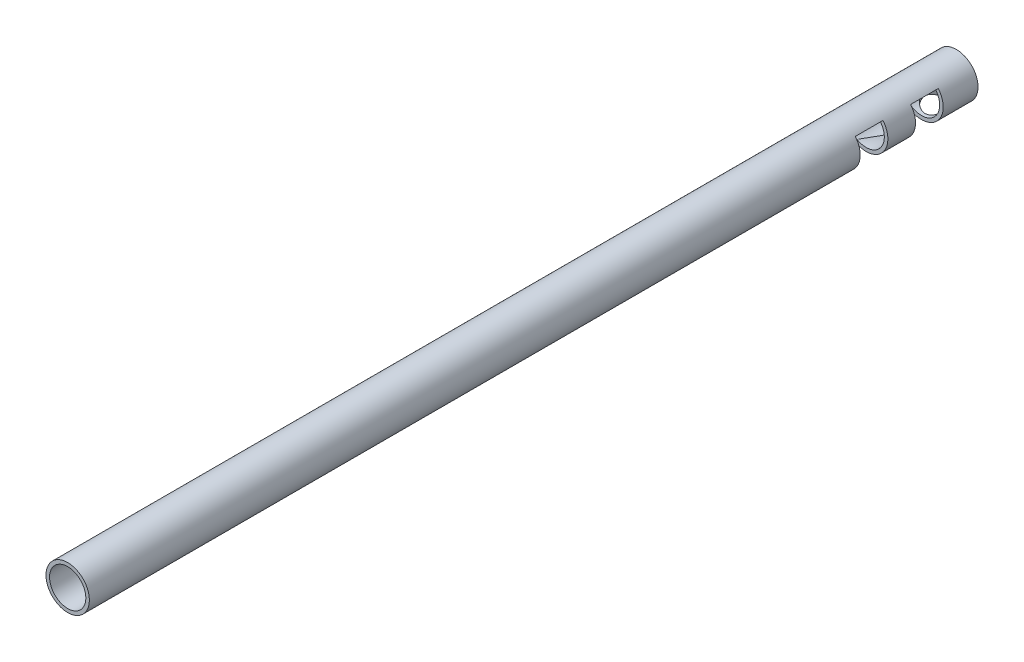
ISO-10303-21;
HEADER;
FILE_DESCRIPTION(('STEP AP214'),'2;1');
FILE_NAME('part.step','',(''),(''),'','','');
FILE_SCHEMA(('AUTOMOTIVE_DESIGN { 1 0 10303 214 1 1 1 1 }'));
ENDSEC;
DATA;
#1=APPLICATION_CONTEXT('core data for automotive mechanical design processes');
#2=APPLICATION_PROTOCOL_DEFINITION('international standard','automotive_design',2000,#1);
#3=PRODUCT_CONTEXT('',#1,'mechanical');
#4=PRODUCT('Part','Part','',(#3));
#5=PRODUCT_RELATED_PRODUCT_CATEGORY('part','',(#4));
#6=PRODUCT_DEFINITION_FORMATION('','',#4);
#7=PRODUCT_DEFINITION_CONTEXT('part definition',#1,'design');
#8=PRODUCT_DEFINITION('design','',#6,#7);
#9=PRODUCT_DEFINITION_SHAPE('','',#8);
#10=(LENGTH_UNIT() NAMED_UNIT(*) SI_UNIT(.MILLI.,.METRE.));
#11=(NAMED_UNIT(*) PLANE_ANGLE_UNIT() SI_UNIT($,.RADIAN.));
#12=(NAMED_UNIT(*) SI_UNIT($,.STERADIAN.) SOLID_ANGLE_UNIT());
#13=UNCERTAINTY_MEASURE_WITH_UNIT(LENGTH_MEASURE(1.E-05),#10,'distance_accuracy_value','');
#14=(GEOMETRIC_REPRESENTATION_CONTEXT(3) GLOBAL_UNCERTAINTY_ASSIGNED_CONTEXT((#13)) GLOBAL_UNIT_ASSIGNED_CONTEXT((#10,
#11,#12)) REPRESENTATION_CONTEXT('',''));
#15=CARTESIAN_POINT('',(0.,0.,0.));
#16=DIRECTION('',(0.,0.,1.));
#17=DIRECTION('',(1.,0.,0.));
#18=AXIS2_PLACEMENT_3D('',#15,#16,#17);
#19=CARTESIAN_POINT('',(0.481952030808046,0.221166659203473,2.984375));
#20=DIRECTION('',(-0.632154340836013,0.774842493260524,0.));
#21=DIRECTION('',(0.,0.,1.));
#22=AXIS2_PLACEMENT_3D('',#19,#20,#21);
#23=PLANE('',#22);
#24=DIRECTION('',(-0.774842493260524,-0.632154340836013,0.));
#25=VECTOR('',#24,1.);
#26=CARTESIAN_POINT('',(0.481952030808046,0.221166659203473,2.5875));
#27=LINE('',#26,#25);
#28=CARTESIAN_POINT('',(0.481952030808046,0.221166659203473,2.5875));
#29=VERTEX_POINT('',#28);
#30=CARTESIAN_POINT('',(0.403393849786335,0.157075059203473,2.5875));
#31=VERTEX_POINT('',#30);
#32=EDGE_CURVE('E78',#29,#31,#27,.T.);
#33=ORIENTED_EDGE('',*,*,#32,.F.);
#34=DIRECTION('',(0.,0.,1.));
#35=VECTOR('',#34,1.);
#36=CARTESIAN_POINT('',(0.481952030808046,0.221166659203473,0.));
#37=LINE('',#36,#35);
#38=CARTESIAN_POINT('',(0.481952030808046,0.221166659203473,3.38125));
#39=VERTEX_POINT('',#38);
#40=EDGE_CURVE('E269',#29,#39,#37,.T.);
#41=ORIENTED_EDGE('',*,*,#40,.T.);
#42=DIRECTION('',(-0.774842493260524,-0.632154340836013,0.));
#43=VECTOR('',#42,1.);
#44=CARTESIAN_POINT('',(0.481952030808046,0.221166659203473,3.38125));
#45=LINE('',#44,#43);
#46=CARTESIAN_POINT('',(0.403393849786335,0.157075059203473,3.38125));
#47=VERTEX_POINT('',#46);
#48=EDGE_CURVE('E104',#39,#47,#45,.T.);
#49=ORIENTED_EDGE('',*,*,#48,.T.);
#50=DIRECTION('',(0.,0.,1.));
#51=VECTOR('',#50,1.);
#52=CARTESIAN_POINT('',(0.403393849786335,0.157075059203473,0.));
#53=LINE('',#52,#51);
#54=EDGE_CURVE('E262',#31,#47,#53,.T.);
#55=ORIENTED_EDGE('',*,*,#54,.F.);
#56=EDGE_LOOP('',(#33,#41,#49,#55));
#57=FACE_BOUND('',#56,.T.);
#58=ADVANCED_FACE('F66',(#57),#23,.F.);
#59=CARTESIAN_POINT('',(0.,-0.172033340796527,3.38125));
#60=DIRECTION('',(0.,0.,1.));
#61=DIRECTION('',(1.,0.,0.));
#62=AXIS2_PLACEMENT_3D('',#59,#60,#61);
#63=PLANE('',#62);
#64=CARTESIAN_POINT('',(0.,-0.172033340796527,3.38125));
#65=DIRECTION('',(0.,0.,-1.));
#66=DIRECTION('',(-1.,0.,0.));
#67=AXIS2_PLACEMENT_3D('',#64,#65,#66);
#68=CIRCLE('',#67,0.622);
#69=CARTESIAN_POINT('',(-0.481952030808046,0.221166659203473,3.38125));
#70=VERTEX_POINT('',#69);
#71=EDGE_CURVE('E267',#39,#70,#68,.T.);
#72=ORIENTED_EDGE('',*,*,#71,.T.);
#73=DIRECTION('',(0.774842493260525,-0.632154340836013,0.));
#74=VECTOR('',#73,1.);
#75=CARTESIAN_POINT('',(-0.481952030808046,0.221166659203473,3.38125));
#76=LINE('',#75,#74);
#77=CARTESIAN_POINT('',(-0.403393849786335,0.157075059203473,3.38125));
#78=VERTEX_POINT('',#77);
#79=EDGE_CURVE('E176',#70,#78,#76,.T.);
#80=ORIENTED_EDGE('',*,*,#79,.T.);
#81=CARTESIAN_POINT('',(0.,-0.172033340796527,3.38125));
#82=DIRECTION('',(0.,0.,1.));
#83=DIRECTION('',(1.,0.,0.));
#84=AXIS2_PLACEMENT_3D('',#81,#82,#83);
#85=CIRCLE('',#84,0.520614);
#86=EDGE_CURVE('E280',#78,#47,#85,.T.);
#87=ORIENTED_EDGE('',*,*,#86,.T.);
#88=ORIENTED_EDGE('',*,*,#48,.F.);
#89=EDGE_LOOP('',(#72,#80,#87,#88));
#90=FACE_BOUND('',#89,.T.);
#91=ADVANCED_FACE('F205',(#90),#63,.F.);
#92=CARTESIAN_POINT('',(0.,-0.172033340796527,25.5));
#93=DIRECTION('',(0.,0.,1.));
#94=DIRECTION('',(1.,0.,0.));
#95=AXIS2_PLACEMENT_3D('',#92,#93,#94);
#96=PLANE('',#95);
#97=CARTESIAN_POINT('',(0.,-0.172033340796527,25.5));
#98=DIRECTION('',(0.,0.,1.));
#99=DIRECTION('',(1.,0.,0.));
#100=AXIS2_PLACEMENT_3D('',#97,#98,#99);
#101=CIRCLE('',#100,0.520614);
#102=CARTESIAN_POINT('',(0.520614,-0.172033340796527,25.5));
#103=VERTEX_POINT('',#102);
#104=EDGE_CURVE('E274',#103,#103,#101,.F.);
#105=ORIENTED_EDGE('',*,*,#104,.T.);
#106=EDGE_LOOP('',(#105));
#107=FACE_BOUND('',#106,.T.);
#108=CARTESIAN_POINT('',(0.,-0.172033340796527,25.5));
#109=DIRECTION('',(0.,0.,-1.));
#110=DIRECTION('',(-1.,0.,0.));
#111=AXIS2_PLACEMENT_3D('',#108,#109,#110);
#112=CIRCLE('',#111,0.622);
#113=CARTESIAN_POINT('',(-0.622,-0.172033340796527,25.5));
#114=VERTEX_POINT('',#113);
#115=EDGE_CURVE('E188',#114,#114,#112,.T.);
#116=ORIENTED_EDGE('',*,*,#115,.F.);
#117=EDGE_LOOP('',(#116));
#118=FACE_BOUND('',#117,.T.);
#119=ADVANCED_FACE('F209',(#107,#118),#96,.T.);
#120=CARTESIAN_POINT('',(0.,-0.172033340796527,0.));
#121=DIRECTION('',(0.,0.,1.));
#122=DIRECTION('',(1.,0.,0.));
#123=AXIS2_PLACEMENT_3D('',#120,#121,#122);
#124=PLANE('',#123);
#125=CARTESIAN_POINT('',(0.,-0.172033340796527,0.));
#126=DIRECTION('',(0.,0.,1.));
#127=DIRECTION('',(1.,0.,0.));
#128=AXIS2_PLACEMENT_3D('',#125,#126,#127);
#129=CIRCLE('',#128,0.520614);
#130=CARTESIAN_POINT('',(0.520614,-0.172033340796527,0.));
#131=VERTEX_POINT('',#130);
#132=EDGE_CURVE('E284',#131,#131,#129,.F.);
#133=ORIENTED_EDGE('',*,*,#132,.F.);
#134=EDGE_LOOP('',(#133));
#135=FACE_BOUND('',#134,.T.);
#136=CARTESIAN_POINT('',(0.,-0.172033340796527,0.));
#137=DIRECTION('',(0.,0.,-1.));
#138=DIRECTION('',(-1.,0.,0.));
#139=AXIS2_PLACEMENT_3D('',#136,#137,#138);
#140=CIRCLE('',#139,0.622);
#141=CARTESIAN_POINT('',(-0.622,-0.172033340796527,0.));
#142=VERTEX_POINT('',#141);
#143=EDGE_CURVE('E254',#142,#142,#140,.T.);
#144=ORIENTED_EDGE('',*,*,#143,.T.);
#145=EDGE_LOOP('',(#144));
#146=FACE_BOUND('',#145,.T.);
#147=ADVANCED_FACE('F213',(#135,#146),#124,.F.);
#148=CARTESIAN_POINT('',(0.,-0.172033340796527,1.));
#149=DIRECTION('',(0.,0.,-1.));
#150=DIRECTION('',(-1.,0.,0.));
#151=AXIS2_PLACEMENT_3D('',#148,#149,#150);
#152=PLANE('',#151);
#153=DIRECTION('',(-0.774842493260524,-0.632154340836013,0.));
#154=VECTOR('',#153,1.);
#155=CARTESIAN_POINT('',(0.481952030808046,0.221166659203473,1.));
#156=LINE('',#155,#154);
#157=CARTESIAN_POINT('',(0.481952030808046,0.221166659203473,1.));
#158=VERTEX_POINT('',#157);
#159=CARTESIAN_POINT('',(0.403393849786335,0.157075059203473,1.));
#160=VERTEX_POINT('',#159);
#161=EDGE_CURVE('E277',#158,#160,#156,.T.);
#162=ORIENTED_EDGE('',*,*,#161,.T.);
#163=CARTESIAN_POINT('',(0.,-0.172033340796527,1.));
#164=DIRECTION('',(0.,0.,1.));
#165=DIRECTION('',(1.,0.,0.));
#166=AXIS2_PLACEMENT_3D('',#163,#164,#165);
#167=CIRCLE('',#166,0.520614);
#168=CARTESIAN_POINT('',(-0.403393849786335,0.157075059203473,1.));
#169=VERTEX_POINT('',#168);
#170=EDGE_CURVE('E117',#169,#160,#167,.T.);
#171=ORIENTED_EDGE('',*,*,#170,.F.);
#172=DIRECTION('',(0.774842493260525,-0.632154340836013,0.));
#173=VECTOR('',#172,1.);
#174=CARTESIAN_POINT('',(-0.481952030808046,0.221166659203473,1.));
#175=LINE('',#174,#173);
#176=CARTESIAN_POINT('',(-0.481952030808046,0.221166659203473,1.));
#177=VERTEX_POINT('',#176);
#178=EDGE_CURVE('E161',#177,#169,#175,.T.);
#179=ORIENTED_EDGE('',*,*,#178,.F.);
#180=CARTESIAN_POINT('',(0.,-0.172033340796527,1.));
#181=DIRECTION('',(0.,0.,1.));
#182=DIRECTION('',(1.,0.,0.));
#183=AXIS2_PLACEMENT_3D('',#180,#181,#182);
#184=CIRCLE('',#183,0.622);
#185=EDGE_CURVE('E251',#177,#158,#184,.T.);
#186=ORIENTED_EDGE('',*,*,#185,.T.);
#187=EDGE_LOOP('',(#162,#171,#179,#186));
#188=FACE_BOUND('',#187,.T.);
#189=ADVANCED_FACE('F219',(#188),#152,.F.);
#190=CARTESIAN_POINT('',(0.481952030808046,0.221166659203473,1.396875));
#191=DIRECTION('',(-0.632154340836013,0.774842493260524,0.));
#192=DIRECTION('',(0.,0.,1.));
#193=AXIS2_PLACEMENT_3D('',#190,#191,#192);
#194=PLANE('',#193);
#195=ORIENTED_EDGE('',*,*,#161,.F.);
#196=DIRECTION('',(0.,0.,1.));
#197=VECTOR('',#196,1.);
#198=CARTESIAN_POINT('',(0.481952030808046,0.221166659203473,0.));
#199=LINE('',#198,#197);
#200=CARTESIAN_POINT('',(0.481952030808046,0.221166659203473,1.79375));
#201=VERTEX_POINT('',#200);
#202=EDGE_CURVE('E256',#158,#201,#199,.T.);
#203=ORIENTED_EDGE('',*,*,#202,.T.);
#204=DIRECTION('',(-0.774842493260524,-0.632154340836013,0.));
#205=VECTOR('',#204,1.);
#206=CARTESIAN_POINT('',(0.481952030808046,0.221166659203473,1.79375));
#207=LINE('',#206,#205);
#208=CARTESIAN_POINT('',(0.403393849786335,0.157075059203473,1.79375));
#209=VERTEX_POINT('',#208);
#210=EDGE_CURVE('E275',#201,#209,#207,.T.);
#211=ORIENTED_EDGE('',*,*,#210,.T.);
#212=DIRECTION('',(0.,0.,1.));
#213=VECTOR('',#212,1.);
#214=CARTESIAN_POINT('',(0.403393849786335,0.157075059203473,0.));
#215=LINE('',#214,#213);
#216=EDGE_CURVE('E149',#160,#209,#215,.T.);
#217=ORIENTED_EDGE('',*,*,#216,.F.);
#218=EDGE_LOOP('',(#195,#203,#211,#217));
#219=FACE_BOUND('',#218,.T.);
#220=ADVANCED_FACE('F223',(#219),#194,.F.);
#221=CARTESIAN_POINT('',(0.,-0.172033340796527,1.79375));
#222=DIRECTION('',(0.,0.,1.));
#223=DIRECTION('',(1.,0.,0.));
#224=AXIS2_PLACEMENT_3D('',#221,#222,#223);
#225=PLANE('',#224);
#226=CARTESIAN_POINT('',(0.,-0.172033340796527,1.79375));
#227=DIRECTION('',(0.,0.,-1.));
#228=DIRECTION('',(-1.,0.,0.));
#229=AXIS2_PLACEMENT_3D('',#226,#227,#228);
#230=CIRCLE('',#229,0.622);
#231=CARTESIAN_POINT('',(-0.481952030808046,0.221166659203473,1.79375));
#232=VERTEX_POINT('',#231);
#233=EDGE_CURVE('E157',#201,#232,#230,.T.);
#234=ORIENTED_EDGE('',*,*,#233,.T.);
#235=DIRECTION('',(0.774842493260525,-0.632154340836013,0.));
#236=VECTOR('',#235,1.);
#237=CARTESIAN_POINT('',(-0.481952030808046,0.221166659203473,1.79375));
#238=LINE('',#237,#236);
#239=CARTESIAN_POINT('',(-0.403393849786335,0.157075059203473,1.79375));
#240=VERTEX_POINT('',#239);
#241=EDGE_CURVE('E154',#232,#240,#238,.T.);
#242=ORIENTED_EDGE('',*,*,#241,.T.);
#243=CARTESIAN_POINT('',(0.,-0.172033340796527,1.79375));
#244=DIRECTION('',(0.,0.,1.));
#245=DIRECTION('',(1.,0.,0.));
#246=AXIS2_PLACEMENT_3D('',#243,#244,#245);
#247=CIRCLE('',#246,0.520614);
#248=EDGE_CURVE('E141',#240,#209,#247,.T.);
#249=ORIENTED_EDGE('',*,*,#248,.T.);
#250=ORIENTED_EDGE('',*,*,#210,.F.);
#251=EDGE_LOOP('',(#234,#242,#249,#250));
#252=FACE_BOUND('',#251,.T.);
#253=ADVANCED_FACE('F155',(#252),#225,.F.);
#254=CARTESIAN_POINT('',(0.,-0.172033340796527,2.5875));
#255=DIRECTION('',(0.,0.,-1.));
#256=DIRECTION('',(-1.,0.,0.));
#257=AXIS2_PLACEMENT_3D('',#254,#255,#256);
#258=PLANE('',#257);
#259=CARTESIAN_POINT('',(0.,-0.172033340796527,2.5875));
#260=DIRECTION('',(0.,0.,1.));
#261=DIRECTION('',(1.,0.,0.));
#262=AXIS2_PLACEMENT_3D('',#259,#260,#261);
#263=CIRCLE('',#262,0.622);
#264=CARTESIAN_POINT('',(-0.481952030808046,0.221166659203473,2.5875));
#265=VERTEX_POINT('',#264);
#266=EDGE_CURVE('E271',#265,#29,#263,.T.);
#267=ORIENTED_EDGE('',*,*,#266,.T.);
#268=ORIENTED_EDGE('',*,*,#32,.T.);
#269=CARTESIAN_POINT('',(0.,-0.172033340796527,2.5875));
#270=DIRECTION('',(0.,0.,1.));
#271=DIRECTION('',(1.,0.,0.));
#272=AXIS2_PLACEMENT_3D('',#269,#270,#271);
#273=CIRCLE('',#272,0.520614);
#274=CARTESIAN_POINT('',(-0.403393849786335,0.157075059203473,2.5875));
#275=VERTEX_POINT('',#274);
#276=EDGE_CURVE('E86',#275,#31,#273,.T.);
#277=ORIENTED_EDGE('',*,*,#276,.F.);
#278=DIRECTION('',(0.774842493260525,-0.632154340836013,0.));
#279=VECTOR('',#278,1.);
#280=CARTESIAN_POINT('',(-0.481952030808046,0.221166659203473,2.5875));
#281=LINE('',#280,#279);
#282=EDGE_CURVE('E179',#265,#275,#281,.T.);
#283=ORIENTED_EDGE('',*,*,#282,.F.);
#284=EDGE_LOOP('',(#267,#268,#277,#283));
#285=FACE_BOUND('',#284,.T.);
#286=ADVANCED_FACE('F230',(#285),#258,.F.);
#287=CARTESIAN_POINT('',(0.,-0.172033340796527,0.));
#288=DIRECTION('',(0.,0.,1.));
#289=DIRECTION('',(1.,0.,0.));
#290=AXIS2_PLACEMENT_3D('',#287,#288,#289);
#291=CYLINDRICAL_SURFACE('',#290,0.520614);
#292=CARTESIAN_POINT('',(0.,-0.692647340796527,0.896875));
#293=CARTESIAN_POINT('',(0.0193237924214463,-0.692646535102989,0.896874165448663));
#294=CARTESIAN_POINT('',(0.0386540705518615,-0.691561822942681,0.895454267223977));
#295=CARTESIAN_POINT('',(0.0766841900538763,-0.687325053261119,0.889871238191039));
#296=CARTESIAN_POINT('',(0.0953835104608104,-0.684171329305617,0.885705896120483));
#297=CARTESIAN_POINT('',(0.131527124990621,-0.67609775228673,0.874919263185292));
#298=CARTESIAN_POINT('',(0.148977689703774,-0.671187594521926,0.868311447928283));
#299=CARTESIAN_POINT('',(0.182407494584698,-0.659965510700044,0.852953359351639));
#300=CARTESIAN_POINT('',(0.198386596242367,-0.6536534528713,0.844202884624694));
#301=CARTESIAN_POINT('',(0.230113582472016,-0.639384113033688,0.823950925421586));
#302=CARTESIAN_POINT('',(0.245701038023515,-0.631328312318714,0.812269027211088));
#303=CARTESIAN_POINT('',(0.274821940150168,-0.61452081455075,0.786976242421508));
#304=CARTESIAN_POINT('',(0.288352374190248,-0.605768124921037,0.773362582061989));
#305=CARTESIAN_POINT('',(0.315903214839729,-0.586261367299401,0.741351593555294));
#306=CARTESIAN_POINT('',(0.329430999741826,-0.575472624350972,0.722549846597942));
#307=CARTESIAN_POINT('',(0.353195580335227,-0.554836197666953,0.682493381532236));
#308=CARTESIAN_POINT('',(0.363436456287419,-0.544987357927506,0.661241749545831));
#309=CARTESIAN_POINT('',(0.377253409241254,-0.53089276108955,0.624221048671502));
#310=CARTESIAN_POINT('',(0.381907188958114,-0.525893597665502,0.609145021426707));
#311=CARTESIAN_POINT('',(0.389436561318631,-0.517590388634999,0.578119191392464));
#312=CARTESIAN_POINT('',(0.392316305255158,-0.5142823887716,0.562171524293702));
#313=CARTESIAN_POINT('',(0.396115316120187,-0.50988086200561,0.529559885604756));
#314=CARTESIAN_POINT('',(0.397014724903252,-0.508809771532088,0.51289035255365));
#315=CARTESIAN_POINT('',(0.396699720538068,-0.509180590501688,0.479596884490811));
#316=CARTESIAN_POINT('',(0.395484901397637,-0.510622982605364,0.462972958850994));
#317=CARTESIAN_POINT('',(0.391328058480278,-0.515412539647922,0.432298995453094));
#318=CARTESIAN_POINT('',(0.38860746358315,-0.518514073122862,0.418177183815906));
#319=CARTESIAN_POINT('',(0.381773908129003,-0.526029796872447,0.39063807538538));
#320=CARTESIAN_POINT('',(0.377659506800404,-0.53044534486173,0.377221524261689));
#321=CARTESIAN_POINT('',(0.365121178012772,-0.543313586189347,0.342784879216577));
#322=CARTESIAN_POINT('',(0.355629190738834,-0.552533441583622,0.322441058113655));
#323=CARTESIAN_POINT('',(0.333647903698436,-0.571951615958476,0.283939638755494));
#324=CARTESIAN_POINT('',(0.321151103971733,-0.582152344332773,0.265787684413591));
#325=CARTESIAN_POINT('',(0.292908453399778,-0.602798927394728,0.231250768570519));
#326=CARTESIAN_POINT('',(0.277077008602928,-0.613243047011336,0.214934435186285));
#327=CARTESIAN_POINT('',(0.242517859037088,-0.633141164918753,0.185015366017719));
#328=CARTESIAN_POINT('',(0.223795235522073,-0.642596852406165,0.171407963526973));
#329=CARTESIAN_POINT('',(0.187444444178045,-0.658054656472714,0.14966595796861));
#330=CARTESIAN_POINT('',(0.170279448263163,-0.664371706080184,0.14098299859776));
#331=CARTESIAN_POINT('',(0.134418202278874,-0.675343052755278,0.126078799596074));
#332=CARTESIAN_POINT('',(0.115724009497045,-0.679999540042844,0.119854316151984));
#333=CARTESIAN_POINT('',(0.0808973219819727,-0.686568682782185,0.111124785029008));
#334=CARTESIAN_POINT('',(0.0649514702386947,-0.68883424550005,0.108138195314196));
#335=CARTESIAN_POINT('',(0.0326719347793708,-0.691873848925178,0.104138037549673));
#336=CARTESIAN_POINT('',(0.0163382856153081,-0.69264802201121,0.103124294386019));
#337=CARTESIAN_POINT('',(-0.0193237924214463,-0.692646535102989,0.103125834551336));
#338=CARTESIAN_POINT('',(-0.0386540705518615,-0.691561822942681,0.104545732776023));
#339=CARTESIAN_POINT('',(-0.0766841900538763,-0.687325053261119,0.110128761808961));
#340=CARTESIAN_POINT('',(-0.0953835104608104,-0.684171329305617,0.114294103879517));
#341=CARTESIAN_POINT('',(-0.131527124990621,-0.67609775228673,0.125080736814708));
#342=CARTESIAN_POINT('',(-0.148977689703774,-0.671187594521926,0.131688552071717));
#343=CARTESIAN_POINT('',(-0.182407494584699,-0.659965510700044,0.147046640648361));
#344=CARTESIAN_POINT('',(-0.198386596242367,-0.6536534528713,0.155797115375307));
#345=CARTESIAN_POINT('',(-0.230113582472016,-0.639384113033688,0.176049074578414));
#346=CARTESIAN_POINT('',(-0.245701038023515,-0.631328312318714,0.187730972788912));
#347=CARTESIAN_POINT('',(-0.274821940150168,-0.61452081455075,0.213023757578492));
#348=CARTESIAN_POINT('',(-0.288352374190248,-0.605768124921037,0.226637417938011));
#349=CARTESIAN_POINT('',(-0.315903214839729,-0.586261367299401,0.258648406444706));
#350=CARTESIAN_POINT('',(-0.329430999741826,-0.575472624350972,0.277450153402059));
#351=CARTESIAN_POINT('',(-0.353195580335227,-0.554836197666952,0.317506618467764));
#352=CARTESIAN_POINT('',(-0.363436456287419,-0.544987357927506,0.338758250454169));
#353=CARTESIAN_POINT('',(-0.377253409241254,-0.53089276108955,0.375778951328498));
#354=CARTESIAN_POINT('',(-0.381907188958114,-0.525893597665502,0.390854978573293));
#355=CARTESIAN_POINT('',(-0.389436561318631,-0.517590388634999,0.421880808607536));
#356=CARTESIAN_POINT('',(-0.392316305255158,-0.5142823887716,0.437828475706299));
#357=CARTESIAN_POINT('',(-0.396115316120187,-0.50988086200561,0.470440114395244));
#358=CARTESIAN_POINT('',(-0.397014724903252,-0.508809771532087,0.48710964744635));
#359=CARTESIAN_POINT('',(-0.396699720538068,-0.509180590501687,0.52040311550919));
#360=CARTESIAN_POINT('',(-0.395484901397637,-0.510622982605364,0.537027041149006));
#361=CARTESIAN_POINT('',(-0.391328058480278,-0.515412539647922,0.567701004546906));
#362=CARTESIAN_POINT('',(-0.38860746358315,-0.518514073122862,0.581822816184095));
#363=CARTESIAN_POINT('',(-0.381773908129003,-0.526029796872447,0.60936192461462));
#364=CARTESIAN_POINT('',(-0.377659506800404,-0.53044534486173,0.622778475738311));
#365=CARTESIAN_POINT('',(-0.365121178012772,-0.543313586189347,0.657215120783423));
#366=CARTESIAN_POINT('',(-0.355629190738834,-0.552533441583622,0.677558941886345));
#367=CARTESIAN_POINT('',(-0.333647903698435,-0.571951615958476,0.716060361244506));
#368=CARTESIAN_POINT('',(-0.321151103971733,-0.582152344332773,0.734212315586409));
#369=CARTESIAN_POINT('',(-0.292908453399777,-0.602798927394729,0.768749231429481));
#370=CARTESIAN_POINT('',(-0.277077008602928,-0.613243047011336,0.785065564813716));
#371=CARTESIAN_POINT('',(-0.242517859037088,-0.633141164918754,0.814984633982281));
#372=CARTESIAN_POINT('',(-0.223795235522073,-0.642596852406165,0.828592036473027));
#373=CARTESIAN_POINT('',(-0.187444444178045,-0.658054656472714,0.850334042031391));
#374=CARTESIAN_POINT('',(-0.170279448263162,-0.664371706080184,0.85901700140224));
#375=CARTESIAN_POINT('',(-0.134418202278873,-0.675343052755278,0.873921200403926));
#376=CARTESIAN_POINT('',(-0.115724009497044,-0.679999540042844,0.880145683848016));
#377=CARTESIAN_POINT('',(-0.0808973219819722,-0.686568682782185,0.888875214970992));
#378=CARTESIAN_POINT('',(-0.0649514702386942,-0.68883424550005,0.891861804685804));
#379=CARTESIAN_POINT('',(-0.0326719347793706,-0.691873848925178,0.895861962450327));
#380=CARTESIAN_POINT('',(-0.016338285615308,-0.69264802201121,0.896875705613981));
#381=CARTESIAN_POINT('',(0.,-0.692647340796527,0.896875));
#382=B_SPLINE_CURVE_WITH_KNOTS('',3,(#292,#293,#294,#295,#296,#297,#298,#299,#300,#301,#302,
#303,#304,#305,#306,#307,#308,#309,#310,#311,#312,#313,#314,#315,#316,#317,#318,#319,#320,#321,
#322,#323,#324,#325,#326,#327,#328,#329,#330,#331,#332,#333,#334,#335,#336,#337,#338,#339,#340,
#341,#342,#343,#344,#345,#346,#347,#348,#349,#350,#351,#352,#353,#354,#355,#356,#357,#358,#359,
#360,#361,#362,#363,#364,#365,#366,#367,#368,#369,#370,#371,#372,#373,#374,#375,#376,#377,#378,
#379,#380,#381),.UNSPECIFIED.,.T.,.F.,(4,2,2,2,2,2,2,2,2,2,2,2,2,2,2,2,2,2,2,2,2,2,2,2,2,2,2,2,
2,2,2,2,2,2,2,2,2,2,2,2,2,2,2,2,4),(0.,0.0579036939792436,0.115854082403242,0.173489406555506,
0.231130150437317,0.294144471035609,0.357250205907717,0.433593842929829,0.509842339597892,
0.559334087848606,0.608709579699065,0.658577979924241,0.70845595736406,0.752430911415046,
0.796451461596172,0.86886044479624,0.941452070746057,1.01620315645995,1.0908243315499,
1.15132673290573,1.21174903609475,1.26071101282079,1.30966864338218,1.36757233736143,
1.42552272578543,1.48315804993769,1.5407987938195,1.60381311441779,1.6669188492899,
1.74326248631201,1.81951098298008,1.86900273123079,1.91837822308125,1.96824662330643,
2.01812460074625,2.06209955479723,2.10612010497836,2.17852908817843,2.25112071412824,
2.32587179984213,2.40049297493208,2.46099537628792,2.52141767947694,2.57037965620297,
2.61933728676437),.UNSPECIFIED.);
#383=CARTESIAN_POINT('',(0.,-0.692647340796527,0.896875));
#384=VERTEX_POINT('',#383);
#385=EDGE_CURVE('E182',#384,#384,#382,.T.);
#386=ORIENTED_EDGE('',*,*,#385,.F.);
#387=EDGE_LOOP('',(#386));
#388=FACE_BOUND('',#387,.T.);
#389=ORIENTED_EDGE('',*,*,#104,.F.);
#390=EDGE_LOOP('',(#389));
#391=FACE_BOUND('',#390,.T.);
#392=ORIENTED_EDGE('',*,*,#86,.F.);
#393=DIRECTION('',(0.,0.,1.));
#394=VECTOR('',#393,1.);
#395=CARTESIAN_POINT('',(-0.403393849786335,0.157075059203473,0.));
#396=LINE('',#395,#394);
#397=EDGE_CURVE('E162',#275,#78,#396,.T.);
#398=ORIENTED_EDGE('',*,*,#397,.F.);
#399=ORIENTED_EDGE('',*,*,#276,.T.);
#400=ORIENTED_EDGE('',*,*,#54,.T.);
#401=EDGE_LOOP('',(#392,#398,#399,#400));
#402=FACE_BOUND('',#401,.T.);
#403=DIRECTION('',(0.,0.,1.));
#404=VECTOR('',#403,1.);
#405=CARTESIAN_POINT('',(-0.403393849786335,0.157075059203473,0.));
#406=LINE('',#405,#404);
#407=EDGE_CURVE('E146',#169,#240,#406,.T.);
#408=ORIENTED_EDGE('',*,*,#407,.F.);
#409=ORIENTED_EDGE('',*,*,#170,.T.);
#410=ORIENTED_EDGE('',*,*,#216,.T.);
#411=ORIENTED_EDGE('',*,*,#248,.F.);
#412=EDGE_LOOP('',(#408,#409,#410,#411));
#413=FACE_BOUND('',#412,.T.);
#414=ORIENTED_EDGE('',*,*,#132,.T.);
#415=EDGE_LOOP('',(#414));
#416=FACE_BOUND('',#415,.T.);
#417=ADVANCED_FACE('F143',(#388,#391,#402,#413,#416),#291,.F.);
#418=CARTESIAN_POINT('',(0.,-0.172033340796527,0.));
#419=DIRECTION('',(0.,0.,1.));
#420=DIRECTION('',(1.,0.,0.));
#421=AXIS2_PLACEMENT_3D('',#418,#419,#420);
#422=CYLINDRICAL_SURFACE('',#421,0.622);
#423=CARTESIAN_POINT('',(0.,-0.794033340796527,0.896875));
#424=CARTESIAN_POINT('',(0.0200840975106349,-0.79403197881448,0.896873535358117));
#425=CARTESIAN_POINT('',(0.0401940304438064,-0.79305033001604,0.895339805682926));
#426=CARTESIAN_POINT('',(0.0797958228101764,-0.789216029413096,0.889288452553933));
#427=CARTESIAN_POINT('',(0.0992863574982261,-0.786359617729765,0.884764832680092));
#428=CARTESIAN_POINT('',(0.136994955964861,-0.779061700819506,0.873001762501514));
#429=CARTESIAN_POINT('',(0.15521894077949,-0.774628261331503,0.865776122263988));
#430=CARTESIAN_POINT('',(0.190126986746702,-0.764541842646203,0.848909299931484));
#431=CARTESIAN_POINT('',(0.206811282359087,-0.758889049567834,0.839268486446006));
#432=CARTESIAN_POINT('',(0.239707305366539,-0.746280143601745,0.816980446718735));
#433=CARTESIAN_POINT('',(0.255769483359073,-0.739255331865314,0.804152138483628));
#434=CARTESIAN_POINT('',(0.28565896494439,-0.724807437782144,0.776273825340559));
#435=CARTESIAN_POINT('',(0.299483080240333,-0.717383806978371,0.761220708369136));
#436=CARTESIAN_POINT('',(0.326508926409837,-0.701705739775835,0.726817851290452));
#437=CARTESIAN_POINT('',(0.339342104598039,-0.693483419554462,0.707161516482886));
#438=CARTESIAN_POINT('',(0.361491160192292,-0.678381265503328,0.665493558373182));
#439=CARTESIAN_POINT('',(0.370813077400361,-0.671499136323312,0.643486063860704));
#440=CARTESIAN_POINT('',(0.383484336526,-0.661798182378061,0.603731253318234));
#441=CARTESIAN_POINT('',(0.387765344376304,-0.658384482921292,0.586427176982535));
#442=CARTESIAN_POINT('',(0.393970035306978,-0.653373158939298,0.551155022219501));
#443=CARTESIAN_POINT('',(0.395897268332395,-0.651772799812223,0.533187985934883));
#444=CARTESIAN_POINT('',(0.39727708928765,-0.650631212605337,0.497036231286165));
#445=CARTESIAN_POINT('',(0.396722187243342,-0.651096216839178,0.47885101943402));
#446=CARTESIAN_POINT('',(0.393159576539774,-0.654023428200985,0.442881090915726));
#447=CARTESIAN_POINT('',(0.390149846688554,-0.656487281079764,0.425096716685004));
#448=CARTESIAN_POINT('',(0.381978184465765,-0.662953359568583,0.390898936444517));
#449=CARTESIAN_POINT('',(0.376880837769601,-0.666909159943554,0.374460781883487));
#450=CARTESIAN_POINT('',(0.364745705749851,-0.675919790935728,0.342645010477912));
#451=CARTESIAN_POINT('',(0.357707270602306,-0.6809749894817,0.32726775095138));
#452=CARTESIAN_POINT('',(0.340334502320753,-0.692789211284171,0.294860299283755));
#453=CARTESIAN_POINT('',(0.329626501852882,-0.699688883747828,0.278081923213067));
#454=CARTESIAN_POINT('',(0.305900022131741,-0.713789803956192,0.246370917411021));
#455=CARTESIAN_POINT('',(0.292878915299219,-0.720991387473823,0.231440419857716));
#456=CARTESIAN_POINT('',(0.262141418706176,-0.736402025083101,0.201105469673195));
#457=CARTESIAN_POINT('',(0.244001762808329,-0.744559255562117,0.186098949216559));
#458=CARTESIAN_POINT('',(0.204998920884547,-0.759651549977033,0.159349715218754));
#459=CARTESIAN_POINT('',(0.184137747286549,-0.766587508165499,0.147604609903578));
#460=CARTESIAN_POINT('',(0.144516527556607,-0.777288397290566,0.129866613712511));
#461=CARTESIAN_POINT('',(0.126155158121646,-0.781409055697339,0.123195805107127));
#462=CARTESIAN_POINT('',(0.0884002035850173,-0.788015536222813,0.112601951384019));
#463=CARTESIAN_POINT('',(0.069009421393032,-0.79050557394338,0.108671819143404));
#464=CARTESIAN_POINT('',(0.04121065744537,-0.79272125983308,0.105183974275291));
#465=CARTESIAN_POINT('',(0.0329973396953371,-0.793212127117995,0.104413076107751));
#466=CARTESIAN_POINT('',(0.0165241456022775,-0.793868481391959,0.10338323480377));
#467=CARTESIAN_POINT('',(0.00826426000304109,-0.794033901228669,0.103124397325103));
#468=CARTESIAN_POINT('',(-0.0200840975106337,-0.794031978814485,0.103126464641875));
#469=CARTESIAN_POINT('',(-0.0401940304438047,-0.793050330016042,0.104660194317072));
#470=CARTESIAN_POINT('',(-0.0797958228101748,-0.789216029413095,0.110711547446069));
#471=CARTESIAN_POINT('',(-0.0992863574982249,-0.786359617729765,0.115235167319909));
#472=CARTESIAN_POINT('',(-0.13699495596486,-0.779061700819507,0.126998237498486));
#473=CARTESIAN_POINT('',(-0.155218940779489,-0.774628261331503,0.134223877736011));
#474=CARTESIAN_POINT('',(-0.190126986746701,-0.764541842646203,0.151090700068515));
#475=CARTESIAN_POINT('',(-0.206811282359086,-0.758889049567835,0.160731513553994));
#476=CARTESIAN_POINT('',(-0.239707305366538,-0.746280143601745,0.183019553281265));
#477=CARTESIAN_POINT('',(-0.255769483359072,-0.739255331865314,0.195847861516371));
#478=CARTESIAN_POINT('',(-0.28565896494439,-0.724807437782144,0.223726174659441));
#479=CARTESIAN_POINT('',(-0.299483080240332,-0.717383806978371,0.238779291630863));
#480=CARTESIAN_POINT('',(-0.326508926409837,-0.701705739775835,0.273182148709547));
#481=CARTESIAN_POINT('',(-0.339342104598038,-0.693483419554462,0.292838483517113));
#482=CARTESIAN_POINT('',(-0.361491160192292,-0.678381265503328,0.334506441626817));
#483=CARTESIAN_POINT('',(-0.370813077400361,-0.671499136323312,0.356513936139295));
#484=CARTESIAN_POINT('',(-0.383484336526,-0.661798182378061,0.396268746681766));
#485=CARTESIAN_POINT('',(-0.387765344376304,-0.658384482921292,0.413572823017464));
#486=CARTESIAN_POINT('',(-0.393970035306978,-0.653373158939298,0.448844977780498));
#487=CARTESIAN_POINT('',(-0.395897268332394,-0.651772799812223,0.466812014065116));
#488=CARTESIAN_POINT('',(-0.39727708928765,-0.650631212605337,0.502963768713834));
#489=CARTESIAN_POINT('',(-0.396722187243342,-0.651096216839178,0.52114898056598));
#490=CARTESIAN_POINT('',(-0.393159576539774,-0.654023428200985,0.557118909084274));
#491=CARTESIAN_POINT('',(-0.390149846688555,-0.656487281079764,0.574903283314996));
#492=CARTESIAN_POINT('',(-0.381978184465765,-0.662953359568582,0.609101063555482));
#493=CARTESIAN_POINT('',(-0.376880837769601,-0.666909159943554,0.625539218116512));
#494=CARTESIAN_POINT('',(-0.364745705749852,-0.675919790935728,0.657354989522087));
#495=CARTESIAN_POINT('',(-0.357707270602307,-0.6809749894817,0.672732249048619));
#496=CARTESIAN_POINT('',(-0.340334502320754,-0.69278921128417,0.705139700716244));
#497=CARTESIAN_POINT('',(-0.329626501852882,-0.699688883747827,0.721918076786932));
#498=CARTESIAN_POINT('',(-0.305900022131741,-0.713789803956192,0.753629082588979));
#499=CARTESIAN_POINT('',(-0.292878915299219,-0.720991387473823,0.768559580142283));
#500=CARTESIAN_POINT('',(-0.262141418706177,-0.736402025083101,0.798894530326804));
#501=CARTESIAN_POINT('',(-0.24400176280833,-0.744559255562116,0.81390105078344));
#502=CARTESIAN_POINT('',(-0.204998920884548,-0.759651549977032,0.840650284781245));
#503=CARTESIAN_POINT('',(-0.18413774728655,-0.766587508165498,0.852395390096422));
#504=CARTESIAN_POINT('',(-0.144516527556608,-0.777288397290566,0.870133386287489));
#505=CARTESIAN_POINT('',(-0.126155158121647,-0.781409055697339,0.876804194892873));
#506=CARTESIAN_POINT('',(-0.0884002035850182,-0.788015536222812,0.887398048615981));
#507=CARTESIAN_POINT('',(-0.069009421393033,-0.79050557394338,0.891328180856595));
#508=CARTESIAN_POINT('',(-0.0412106574453709,-0.79272125983308,0.89481602572471));
#509=CARTESIAN_POINT('',(-0.0329973396953379,-0.793212127117996,0.89558692389225));
#510=CARTESIAN_POINT('',(-0.0165241456022777,-0.793868481391958,0.896616765196228));
#511=CARTESIAN_POINT('',(-0.00826426000304076,-0.794033901228667,0.896875602674894));
#512=CARTESIAN_POINT('',(0.,-0.794033340796527,0.896875));
#513=B_SPLINE_CURVE_WITH_KNOTS('',3,(#423,#424,#425,#426,#427,#428,#429,#430,#431,#432,#433,
#434,#435,#436,#437,#438,#439,#440,#441,#442,#443,#444,#445,#446,#447,#448,#449,#450,#451,#452,
#453,#454,#455,#456,#457,#458,#459,#460,#461,#462,#463,#464,#465,#466,#467,#468,#469,#470,#471,
#472,#473,#474,#475,#476,#477,#478,#479,#480,#481,#482,#483,#484,#485,#486,#487,#488,#489,#490,
#491,#492,#493,#494,#495,#496,#497,#498,#499,#500,#501,#502,#503,#504,#505,#506,#507,#508,#509,
#510,#511,#512),.UNSPECIFIED.,.T.,.F.,(4,2,2,2,2,2,2,2,2,2,2,2,2,2,2,2,2,2,2,2,2,2,2,2,2,2,2,2,
2,2,2,2,2,2,2,2,2,2,2,2,2,2,2,2,4),(0.,0.0602177534061881,0.120556645407481,0.180591268253048,
0.240616734047577,0.305538294833278,0.370551542808831,0.44481701575996,0.518954153142554,
0.573180292642965,0.627324547301046,0.681632295152054,0.735984802689026,0.788769484195245,
0.84157185808206,0.904540940920475,0.967582016467158,1.04196400029651,1.11629129081686,
1.17593975002998,1.23543338635864,1.26020684293076,1.28498541068488,1.34520316409107,
1.40554205609237,1.46557667893793,1.52560214473246,1.59052370551816,1.65553695349372,
1.72980242644485,1.80393956382744,1.85816570332785,1.91230995798593,1.96661770583694,
2.02097021337391,2.07375489488013,2.12655726876694,2.18952635160536,2.25256742715204,
2.3269494109814,2.40127670150174,2.46092516071486,2.52041879704352,2.54519225361564,
2.56997082136977),.UNSPECIFIED.);
#514=CARTESIAN_POINT('',(0.,-0.794033340796527,0.896875));
#515=VERTEX_POINT('',#514);
#516=EDGE_CURVE('E12',#515,#515,#513,.T.);
#517=ORIENTED_EDGE('',*,*,#516,.T.);
#518=EDGE_LOOP('',(#517));
#519=FACE_BOUND('',#518,.T.);
#520=ORIENTED_EDGE('',*,*,#115,.T.);
#521=EDGE_LOOP('',(#520));
#522=FACE_BOUND('',#521,.T.);
#523=DIRECTION('',(0.,0.,1.));
#524=VECTOR('',#523,1.);
#525=CARTESIAN_POINT('',(-0.481952030808046,0.221166659203473,0.));
#526=LINE('',#525,#524);
#527=EDGE_CURVE('E166',#265,#70,#526,.T.);
#528=ORIENTED_EDGE('',*,*,#527,.T.);
#529=ORIENTED_EDGE('',*,*,#71,.F.);
#530=ORIENTED_EDGE('',*,*,#40,.F.);
#531=ORIENTED_EDGE('',*,*,#266,.F.);
#532=EDGE_LOOP('',(#528,#529,#530,#531));
#533=FACE_BOUND('',#532,.T.);
#534=ORIENTED_EDGE('',*,*,#185,.F.);
#535=DIRECTION('',(0.,0.,1.));
#536=VECTOR('',#535,1.);
#537=CARTESIAN_POINT('',(-0.481952030808046,0.221166659203473,0.));
#538=LINE('',#537,#536);
#539=EDGE_CURVE('E171',#177,#232,#538,.T.);
#540=ORIENTED_EDGE('',*,*,#539,.T.);
#541=ORIENTED_EDGE('',*,*,#233,.F.);
#542=ORIENTED_EDGE('',*,*,#202,.F.);
#543=EDGE_LOOP('',(#534,#540,#541,#542));
#544=FACE_BOUND('',#543,.T.);
#545=ORIENTED_EDGE('',*,*,#143,.F.);
#546=EDGE_LOOP('',(#545));
#547=FACE_BOUND('',#546,.T.);
#548=ADVANCED_FACE('F195',(#519,#522,#533,#544,#547),#422,.T.);
#549=CARTESIAN_POINT('',(0.,-10.,0.5));
#550=DIRECTION('',(0.,1.,0.));
#551=DIRECTION('',(0.,0.,1.));
#552=AXIS2_PLACEMENT_3D('',#549,#550,#551);
#553=CYLINDRICAL_SURFACE('',#552,0.396875);
#554=ORIENTED_EDGE('',*,*,#516,.F.);
#555=EDGE_LOOP('',(#554));
#556=FACE_BOUND('',#555,.T.);
#557=ORIENTED_EDGE('',*,*,#385,.T.);
#558=EDGE_LOOP('',(#557));
#559=FACE_BOUND('',#558,.T.);
#560=ADVANCED_FACE('F190',(#556,#559),#553,.F.);
#561=CARTESIAN_POINT('',(-0.481952030808046,0.221166659203473,2.984375));
#562=DIRECTION('',(0.632154340836013,0.774842493260525,0.));
#563=DIRECTION('',(0.,0.,1.));
#564=AXIS2_PLACEMENT_3D('',#561,#562,#563);
#565=PLANE('',#564);
#566=ORIENTED_EDGE('',*,*,#282,.T.);
#567=ORIENTED_EDGE('',*,*,#397,.T.);
#568=ORIENTED_EDGE('',*,*,#79,.F.);
#569=ORIENTED_EDGE('',*,*,#527,.F.);
#570=EDGE_LOOP('',(#566,#567,#568,#569));
#571=FACE_BOUND('',#570,.T.);
#572=ADVANCED_FACE('F194',(#571),#565,.F.);
#573=CARTESIAN_POINT('',(-0.481952030808046,0.221166659203473,1.396875));
#574=DIRECTION('',(0.632154340836013,0.774842493260525,0.));
#575=DIRECTION('',(0.,0.,1.));
#576=AXIS2_PLACEMENT_3D('',#573,#574,#575);
#577=PLANE('',#576);
#578=ORIENTED_EDGE('',*,*,#178,.T.);
#579=ORIENTED_EDGE('',*,*,#407,.T.);
#580=ORIENTED_EDGE('',*,*,#241,.F.);
#581=ORIENTED_EDGE('',*,*,#539,.F.);
#582=EDGE_LOOP('',(#578,#579,#580,#581));
#583=FACE_BOUND('',#582,.T.);
#584=ADVANCED_FACE('F164',(#583),#577,.F.);
#585=CLOSED_SHELL('',(#58,#91,#119,#147,#189,#220,#253,#286,#417,#548,#560,#572,#584));
#586=MANIFOLD_SOLID_BREP('B2',#585);
#587=ADVANCED_BREP_SHAPE_REPRESENTATION('',(#18,#586),#14);
#588=SHAPE_DEFINITION_REPRESENTATION(#9,#587);
ENDSEC;
END-ISO-10303-21;
